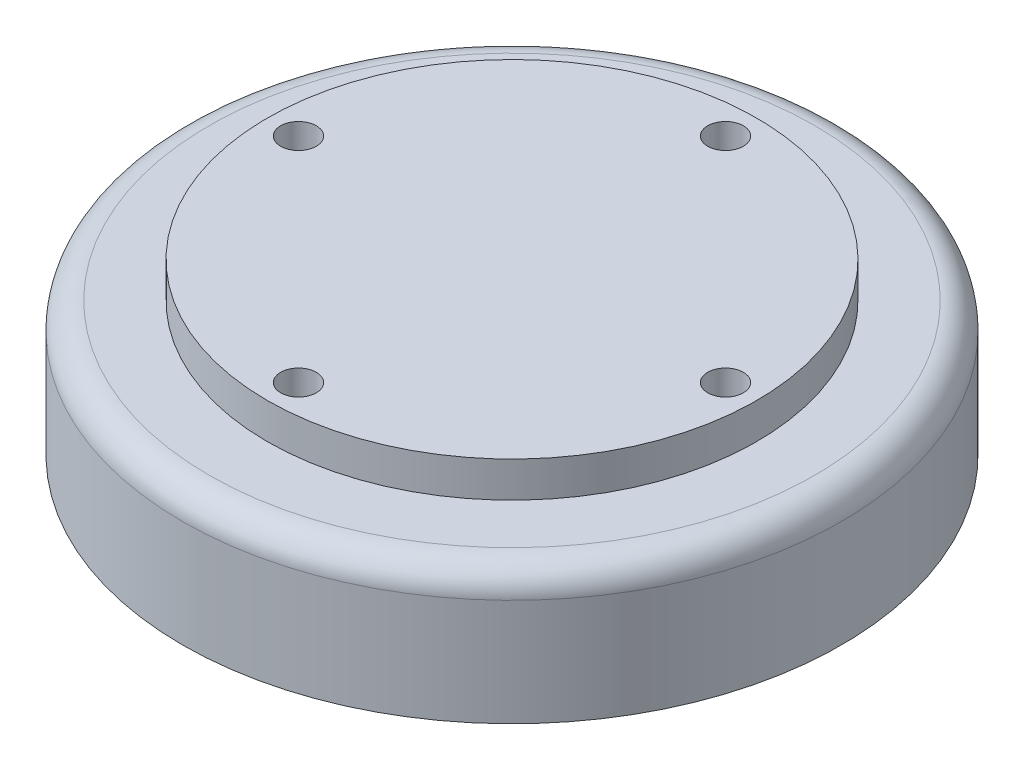
ISO-10303-21;
HEADER;
FILE_DESCRIPTION(('STEP AP214'),'2;1');
FILE_NAME('part.step','',(''),(''),'','','');
FILE_SCHEMA(('AUTOMOTIVE_DESIGN { 1 0 10303 214 1 1 1 1 }'));
ENDSEC;
DATA;
#1=APPLICATION_CONTEXT('core data for automotive mechanical design processes');
#2=APPLICATION_PROTOCOL_DEFINITION('international standard','automotive_design',2000,#1);
#3=PRODUCT_CONTEXT('',#1,'mechanical');
#4=PRODUCT('Part','Part','',(#3));
#5=PRODUCT_RELATED_PRODUCT_CATEGORY('part','',(#4));
#6=PRODUCT_DEFINITION_FORMATION('','',#4);
#7=PRODUCT_DEFINITION_CONTEXT('part definition',#1,'design');
#8=PRODUCT_DEFINITION('design','',#6,#7);
#9=PRODUCT_DEFINITION_SHAPE('','',#8);
#10=(LENGTH_UNIT() NAMED_UNIT(*) SI_UNIT(.MILLI.,.METRE.));
#11=(NAMED_UNIT(*) PLANE_ANGLE_UNIT() SI_UNIT($,.RADIAN.));
#12=(NAMED_UNIT(*) SI_UNIT($,.STERADIAN.) SOLID_ANGLE_UNIT());
#13=UNCERTAINTY_MEASURE_WITH_UNIT(LENGTH_MEASURE(1.E-05),#10,'distance_accuracy_value','');
#14=(GEOMETRIC_REPRESENTATION_CONTEXT(3) GLOBAL_UNCERTAINTY_ASSIGNED_CONTEXT((#13)) GLOBAL_UNIT_ASSIGNED_CONTEXT((#10,
#11,#12)) REPRESENTATION_CONTEXT('',''));
#15=CARTESIAN_POINT('',(0.,0.,0.));
#16=DIRECTION('',(0.,0.,1.));
#17=DIRECTION('',(1.,0.,0.));
#18=AXIS2_PLACEMENT_3D('',#15,#16,#17);
#19=CARTESIAN_POINT('',(0.,4.,0.));
#20=DIRECTION('',(0.,-1.,0.));
#21=DIRECTION('',(0.,0.,-1.));
#22=AXIS2_PLACEMENT_3D('',#19,#20,#21);
#23=CYLINDRICAL_SURFACE('',#22,27.469);
#24=CARTESIAN_POINT('',(0.,4.,0.));
#25=DIRECTION('',(0.,1.,0.));
#26=DIRECTION('',(0.,0.,1.));
#27=AXIS2_PLACEMENT_3D('',#24,#25,#26);
#28=CIRCLE('',#27,27.469);
#29=CARTESIAN_POINT('',(0.,4.,27.469));
#30=VERTEX_POINT('',#29);
#31=EDGE_CURVE('E149',#30,#30,#28,.T.);
#32=ORIENTED_EDGE('',*,*,#31,.F.);
#33=EDGE_LOOP('',(#32));
#34=FACE_BOUND('',#33,.T.);
#35=CARTESIAN_POINT('',(0.,0.,0.));
#36=DIRECTION('',(0.,1.,0.));
#37=DIRECTION('',(0.,0.,1.));
#38=AXIS2_PLACEMENT_3D('',#35,#36,#37);
#39=CIRCLE('',#38,27.469);
#40=CARTESIAN_POINT('',(0.,0.,27.469));
#41=VERTEX_POINT('',#40);
#42=EDGE_CURVE('E145',#41,#41,#39,.T.);
#43=ORIENTED_EDGE('',*,*,#42,.T.);
#44=EDGE_LOOP('',(#43));
#45=FACE_BOUND('',#44,.T.);
#46=ADVANCED_FACE('F33',(#34,#45),#23,.T.);
#47=CARTESIAN_POINT('',(0.,4.,0.));
#48=DIRECTION('',(0.,1.,0.));
#49=DIRECTION('',(0.,0.,1.));
#50=AXIS2_PLACEMENT_3D('',#47,#48,#49);
#51=PLANE('',#50);
#52=CARTESIAN_POINT('',(-23.971,4.,0.));
#53=DIRECTION('',(0.,1.,0.));
#54=DIRECTION('',(0.,0.,1.));
#55=AXIS2_PLACEMENT_3D('',#52,#53,#54);
#56=CIRCLE('',#55,2.);
#57=CARTESIAN_POINT('',(-23.971,4.,2.));
#58=VERTEX_POINT('',#57);
#59=EDGE_CURVE('E146',#58,#58,#56,.T.);
#60=ORIENTED_EDGE('',*,*,#59,.F.);
#61=EDGE_LOOP('',(#60));
#62=FACE_BOUND('',#61,.T.);
#63=CARTESIAN_POINT('',(0.,4.,-23.971));
#64=DIRECTION('',(0.,1.,0.));
#65=DIRECTION('',(0.,0.,1.));
#66=AXIS2_PLACEMENT_3D('',#63,#64,#65);
#67=CIRCLE('',#66,2.);
#68=CARTESIAN_POINT('',(0.,4.,-21.971));
#69=VERTEX_POINT('',#68);
#70=EDGE_CURVE('E150',#69,#69,#67,.T.);
#71=ORIENTED_EDGE('',*,*,#70,.F.);
#72=EDGE_LOOP('',(#71));
#73=FACE_BOUND('',#72,.T.);
#74=CARTESIAN_POINT('',(23.971,4.,0.));
#75=DIRECTION('',(0.,1.,0.));
#76=DIRECTION('',(0.,0.,1.));
#77=AXIS2_PLACEMENT_3D('',#74,#75,#76);
#78=CIRCLE('',#77,2.);
#79=CARTESIAN_POINT('',(23.971,4.,2.));
#80=VERTEX_POINT('',#79);
#81=EDGE_CURVE('E153',#80,#80,#78,.T.);
#82=ORIENTED_EDGE('',*,*,#81,.F.);
#83=EDGE_LOOP('',(#82));
#84=FACE_BOUND('',#83,.T.);
#85=CARTESIAN_POINT('',(0.,4.,23.971));
#86=DIRECTION('',(0.,1.,0.));
#87=DIRECTION('',(0.,0.,1.));
#88=AXIS2_PLACEMENT_3D('',#85,#86,#87);
#89=CIRCLE('',#88,2.);
#90=CARTESIAN_POINT('',(0.,4.,25.971));
#91=VERTEX_POINT('',#90);
#92=EDGE_CURVE('E156',#91,#91,#89,.T.);
#93=ORIENTED_EDGE('',*,*,#92,.F.);
#94=EDGE_LOOP('',(#93));
#95=FACE_BOUND('',#94,.T.);
#96=ORIENTED_EDGE('',*,*,#31,.T.);
#97=EDGE_LOOP('',(#96));
#98=FACE_BOUND('',#97,.T.);
#99=ADVANCED_FACE('F205',(#62,#73,#84,#95,#98),#51,.T.);
#100=CARTESIAN_POINT('',(0.,0.,23.971));
#101=DIRECTION('',(0.,1.,0.));
#102=DIRECTION('',(0.,0.,1.));
#103=AXIS2_PLACEMENT_3D('',#100,#101,#102);
#104=CYLINDRICAL_SURFACE('',#103,2.);
#105=ORIENTED_EDGE('',*,*,#92,.T.);
#106=EDGE_LOOP('',(#105));
#107=FACE_BOUND('',#106,.T.);
#108=CARTESIAN_POINT('',(0.,-7.,23.971));
#109=DIRECTION('',(0.,-1.,0.));
#110=DIRECTION('',(0.,0.,-1.));
#111=AXIS2_PLACEMENT_3D('',#108,#109,#110);
#112=CIRCLE('',#111,2.);
#113=CARTESIAN_POINT('',(0.,-7.,21.971));
#114=VERTEX_POINT('',#113);
#115=EDGE_CURVE('E168',#114,#114,#112,.T.);
#116=ORIENTED_EDGE('',*,*,#115,.T.);
#117=EDGE_LOOP('',(#116));
#118=FACE_BOUND('',#117,.T.);
#119=ADVANCED_FACE('F210',(#107,#118),#104,.F.);
#120=CARTESIAN_POINT('',(23.971,0.,0.));
#121=DIRECTION('',(0.,1.,0.));
#122=DIRECTION('',(0.,0.,1.));
#123=AXIS2_PLACEMENT_3D('',#120,#121,#122);
#124=CYLINDRICAL_SURFACE('',#123,2.);
#125=ORIENTED_EDGE('',*,*,#81,.T.);
#126=EDGE_LOOP('',(#125));
#127=FACE_BOUND('',#126,.T.);
#128=CARTESIAN_POINT('',(23.971,-7.,0.));
#129=DIRECTION('',(0.,-1.,0.));
#130=DIRECTION('',(0.,0.,-1.));
#131=AXIS2_PLACEMENT_3D('',#128,#129,#130);
#132=CIRCLE('',#131,2.);
#133=CARTESIAN_POINT('',(23.971,-7.,-2.00000000000001));
#134=VERTEX_POINT('',#133);
#135=EDGE_CURVE('E170',#134,#134,#132,.T.);
#136=ORIENTED_EDGE('',*,*,#135,.T.);
#137=EDGE_LOOP('',(#136));
#138=FACE_BOUND('',#137,.T.);
#139=ADVANCED_FACE('F200',(#127,#138),#124,.F.);
#140=CARTESIAN_POINT('',(0.,0.,-23.971));
#141=DIRECTION('',(0.,1.,0.));
#142=DIRECTION('',(0.,0.,1.));
#143=AXIS2_PLACEMENT_3D('',#140,#141,#142);
#144=CYLINDRICAL_SURFACE('',#143,2.);
#145=ORIENTED_EDGE('',*,*,#70,.T.);
#146=EDGE_LOOP('',(#145));
#147=FACE_BOUND('',#146,.T.);
#148=CARTESIAN_POINT('',(0.,-7.,-23.971));
#149=DIRECTION('',(0.,-1.,0.));
#150=DIRECTION('',(0.,0.,-1.));
#151=AXIS2_PLACEMENT_3D('',#148,#149,#150);
#152=CIRCLE('',#151,2.);
#153=CARTESIAN_POINT('',(0.,-7.,-25.971));
#154=VERTEX_POINT('',#153);
#155=EDGE_CURVE('E37',#154,#154,#152,.T.);
#156=ORIENTED_EDGE('',*,*,#155,.T.);
#157=EDGE_LOOP('',(#156));
#158=FACE_BOUND('',#157,.T.);
#159=ADVANCED_FACE('F177',(#147,#158),#144,.F.);
#160=CARTESIAN_POINT('',(-23.971,0.,0.));
#161=DIRECTION('',(0.,1.,0.));
#162=DIRECTION('',(0.,0.,1.));
#163=AXIS2_PLACEMENT_3D('',#160,#161,#162);
#164=CYLINDRICAL_SURFACE('',#163,2.);
#165=ORIENTED_EDGE('',*,*,#59,.T.);
#166=EDGE_LOOP('',(#165));
#167=FACE_BOUND('',#166,.T.);
#168=CARTESIAN_POINT('',(-23.971,-7.,0.));
#169=DIRECTION('',(0.,-1.,0.));
#170=DIRECTION('',(0.,0.,-1.));
#171=AXIS2_PLACEMENT_3D('',#168,#169,#170);
#172=CIRCLE('',#171,2.);
#173=CARTESIAN_POINT('',(-23.971,-7.,-2.));
#174=VERTEX_POINT('',#173);
#175=EDGE_CURVE('E165',#174,#174,#172,.T.);
#176=ORIENTED_EDGE('',*,*,#175,.T.);
#177=EDGE_LOOP('',(#176));
#178=FACE_BOUND('',#177,.T.);
#179=ADVANCED_FACE('F188',(#167,#178),#164,.F.);
#180=CARTESIAN_POINT('',(0.,0.,0.));
#181=DIRECTION('',(0.,-1.,0.));
#182=DIRECTION('',(0.,0.,-1.));
#183=AXIS2_PLACEMENT_3D('',#180,#181,#182);
#184=PLANE('',#183);
#185=CARTESIAN_POINT('',(0.,0.,0.));
#186=DIRECTION('',(0.,-1.,0.));
#187=DIRECTION('',(0.,0.,-1.));
#188=AXIS2_PLACEMENT_3D('',#185,#186,#187);
#189=CIRCLE('',#188,34.);
#190=CARTESIAN_POINT('',(0.,0.,-34.));
#191=VERTEX_POINT('',#190);
#192=EDGE_CURVE('E11',#191,#191,#189,.F.);
#193=ORIENTED_EDGE('',*,*,#192,.T.);
#194=EDGE_LOOP('',(#193));
#195=FACE_BOUND('',#194,.T.);
#196=ORIENTED_EDGE('',*,*,#42,.F.);
#197=EDGE_LOOP('',(#196));
#198=FACE_BOUND('',#197,.T.);
#199=ADVANCED_FACE('F190',(#195,#198),#184,.F.);
#200=CARTESIAN_POINT('',(0.,-15.,0.));
#201=DIRECTION('',(0.,-1.,0.));
#202=DIRECTION('',(0.,0.,-1.));
#203=AXIS2_PLACEMENT_3D('',#200,#201,#202);
#204=PLANE('',#203);
#205=DIRECTION('',(-0.81629577618712,0.,-0.577634145267632));
#206=VECTOR('',#205,1.);
#207=CARTESIAN_POINT('',(-2.97767565613404,-15.,32.1942041526142));
#208=LINE('',#207,#206);
#209=CARTESIAN_POINT('',(-2.97767565613404,-15.,32.1942041526142));
#210=VERTEX_POINT('',#209);
#211=CARTESIAN_POINT('',(-29.3698364788534,-15.,13.5183593138645));
#212=VERTEX_POINT('',#211);
#213=EDGE_CURVE('E50',#210,#212,#208,.T.);
#214=ORIENTED_EDGE('',*,*,#213,.F.);
#215=DIRECTION('',(-0.90839373198864,0.,0.418115806546166));
#216=VECTOR('',#215,1.);
#217=CARTESIAN_POINT('',(26.3921608227193,-15.,18.6758448387497));
#218=LINE('',#217,#216);
#219=CARTESIAN_POINT('',(26.3921608227193,-15.,18.6758448387497));
#220=VERTEX_POINT('',#219);
#221=EDGE_CURVE('E133',#220,#210,#218,.T.);
#222=ORIENTED_EDGE('',*,*,#221,.F.);
#223=DIRECTION('',(-0.09209795580152,0.,0.995749951813798));
#224=VECTOR('',#223,1.);
#225=CARTESIAN_POINT('',(29.3698364788533,-15.,-13.5183593138645));
#226=LINE('',#225,#224);
#227=CARTESIAN_POINT('',(29.3698364788533,-15.,-13.5183593138645));
#228=VERTEX_POINT('',#227);
#229=EDGE_CURVE('E131',#228,#220,#226,.T.);
#230=ORIENTED_EDGE('',*,*,#229,.F.);
#231=DIRECTION('',(0.81629577618712,0.,0.577634145267632));
#232=VECTOR('',#231,1.);
#233=CARTESIAN_POINT('',(2.97767565613402,-15.,-32.1942041526142));
#234=LINE('',#233,#232);
#235=CARTESIAN_POINT('',(2.97767565613402,-15.,-32.1942041526142));
#236=VERTEX_POINT('',#235);
#237=EDGE_CURVE('E98',#236,#228,#234,.T.);
#238=ORIENTED_EDGE('',*,*,#237,.F.);
#239=DIRECTION('',(0.90839373198864,0.,-0.418115806546166));
#240=VECTOR('',#239,1.);
#241=CARTESIAN_POINT('',(-26.3921608227193,-15.,-18.6758448387497));
#242=LINE('',#241,#240);
#243=CARTESIAN_POINT('',(-26.3921608227193,-15.,-18.6758448387497));
#244=VERTEX_POINT('',#243);
#245=EDGE_CURVE('E127',#244,#236,#242,.T.);
#246=ORIENTED_EDGE('',*,*,#245,.F.);
#247=DIRECTION('',(0.0920979558015204,0.,-0.995749951813798));
#248=VECTOR('',#247,1.);
#249=CARTESIAN_POINT('',(-29.3698364788534,-15.,13.5183593138645));
#250=LINE('',#249,#248);
#251=EDGE_CURVE('E124',#212,#244,#250,.T.);
#252=ORIENTED_EDGE('',*,*,#251,.F.);
#253=EDGE_LOOP('',(#214,#222,#230,#238,#246,#252));
#254=FACE_BOUND('',#253,.T.);
#255=CARTESIAN_POINT('',(0.,-15.,0.));
#256=DIRECTION('',(0.,-1.,0.));
#257=DIRECTION('',(0.,0.,-1.));
#258=AXIS2_PLACEMENT_3D('',#255,#256,#257);
#259=CIRCLE('',#258,37.);
#260=CARTESIAN_POINT('',(0.,-15.,-37.));
#261=VERTEX_POINT('',#260);
#262=EDGE_CURVE('E137',#261,#261,#259,.T.);
#263=ORIENTED_EDGE('',*,*,#262,.T.);
#264=EDGE_LOOP('',(#263));
#265=FACE_BOUND('',#264,.T.);
#266=ADVANCED_FACE('F197',(#254,#265),#204,.T.);
#267=CARTESIAN_POINT('',(0.,-15.,0.));
#268=DIRECTION('',(0.,1.,0.));
#269=DIRECTION('',(0.,0.,1.));
#270=AXIS2_PLACEMENT_3D('',#267,#268,#269);
#271=CYLINDRICAL_SURFACE('',#270,37.);
#272=CARTESIAN_POINT('',(0.,-3.,0.));
#273=DIRECTION('',(0.,-1.,0.));
#274=DIRECTION('',(0.,0.,-1.));
#275=AXIS2_PLACEMENT_3D('',#272,#273,#274);
#276=CIRCLE('',#275,37.);
#277=CARTESIAN_POINT('',(0.,-3.,-37.));
#278=VERTEX_POINT('',#277);
#279=EDGE_CURVE('E42',#278,#278,#276,.T.);
#280=ORIENTED_EDGE('',*,*,#279,.T.);
#281=EDGE_LOOP('',(#280));
#282=FACE_BOUND('',#281,.T.);
#283=ORIENTED_EDGE('',*,*,#262,.F.);
#284=EDGE_LOOP('',(#283));
#285=FACE_BOUND('',#284,.T.);
#286=ADVANCED_FACE('F266',(#282,#285),#271,.T.);
#287=CARTESIAN_POINT('',(-2.97767565613404,-7.,32.1942041526142));
#288=DIRECTION('',(-0.577634145267632,0.,0.81629577618712));
#289=DIRECTION('',(0.81629577618712,0.,0.577634145267632));
#290=AXIS2_PLACEMENT_3D('',#287,#288,#289);
#291=PLANE('',#290);
#292=ORIENTED_EDGE('',*,*,#213,.T.);
#293=DIRECTION('',(0.,-1.,0.));
#294=VECTOR('',#293,1.);
#295=CARTESIAN_POINT('',(-29.3698364788534,-7.,13.5183593138645));
#296=LINE('',#295,#294);
#297=CARTESIAN_POINT('',(-29.3698364788534,-7.,13.5183593138645));
#298=VERTEX_POINT('',#297);
#299=EDGE_CURVE('E80',#298,#212,#296,.T.);
#300=ORIENTED_EDGE('',*,*,#299,.F.);
#301=DIRECTION('',(-0.81629577618712,0.,-0.577634145267632));
#302=VECTOR('',#301,1.);
#303=CARTESIAN_POINT('',(-2.97767565613404,-7.,32.1942041526142));
#304=LINE('',#303,#302);
#305=CARTESIAN_POINT('',(-2.97767565613404,-7.,32.1942041526142));
#306=VERTEX_POINT('',#305);
#307=EDGE_CURVE('E135',#306,#298,#304,.T.);
#308=ORIENTED_EDGE('',*,*,#307,.F.);
#309=DIRECTION('',(0.,-1.,0.));
#310=VECTOR('',#309,1.);
#311=CARTESIAN_POINT('',(-2.97767565613404,-7.,32.1942041526142));
#312=LINE('',#311,#310);
#313=EDGE_CURVE('E58',#306,#210,#312,.T.);
#314=ORIENTED_EDGE('',*,*,#313,.T.);
#315=EDGE_LOOP('',(#292,#300,#308,#314));
#316=FACE_BOUND('',#315,.T.);
#317=ADVANCED_FACE('F304',(#316),#291,.F.);
#318=CARTESIAN_POINT('',(26.3921608227193,-7.,18.6758448387497));
#319=DIRECTION('',(0.418115806546166,0.,0.90839373198864));
#320=DIRECTION('',(0.90839373198864,0.,-0.418115806546166));
#321=AXIS2_PLACEMENT_3D('',#318,#319,#320);
#322=PLANE('',#321);
#323=ORIENTED_EDGE('',*,*,#221,.T.);
#324=ORIENTED_EDGE('',*,*,#313,.F.);
#325=DIRECTION('',(-0.90839373198864,0.,0.418115806546166));
#326=VECTOR('',#325,1.);
#327=CARTESIAN_POINT('',(26.3921608227193,-7.,18.6758448387497));
#328=LINE('',#327,#326);
#329=CARTESIAN_POINT('',(26.3921608227193,-7.,18.6758448387497));
#330=VERTEX_POINT('',#329);
#331=EDGE_CURVE('E110',#330,#306,#328,.T.);
#332=ORIENTED_EDGE('',*,*,#331,.F.);
#333=DIRECTION('',(0.,-1.,0.));
#334=VECTOR('',#333,1.);
#335=CARTESIAN_POINT('',(26.3921608227193,-7.,18.6758448387497));
#336=LINE('',#335,#334);
#337=EDGE_CURVE('E102',#330,#220,#336,.T.);
#338=ORIENTED_EDGE('',*,*,#337,.T.);
#339=EDGE_LOOP('',(#323,#324,#332,#338));
#340=FACE_BOUND('',#339,.T.);
#341=ADVANCED_FACE('F310',(#340),#322,.F.);
#342=CARTESIAN_POINT('',(29.3698364788533,-7.,-13.5183593138645));
#343=DIRECTION('',(0.995749951813798,0.,0.09209795580152));
#344=DIRECTION('',(0.09209795580152,0.,-0.995749951813798));
#345=AXIS2_PLACEMENT_3D('',#342,#343,#344);
#346=PLANE('',#345);
#347=ORIENTED_EDGE('',*,*,#229,.T.);
#348=ORIENTED_EDGE('',*,*,#337,.F.);
#349=DIRECTION('',(-0.09209795580152,0.,0.995749951813798));
#350=VECTOR('',#349,1.);
#351=CARTESIAN_POINT('',(29.3698364788533,-7.,-13.5183593138645));
#352=LINE('',#351,#350);
#353=CARTESIAN_POINT('',(29.3698364788533,-7.,-13.5183593138645));
#354=VERTEX_POINT('',#353);
#355=EDGE_CURVE('E106',#354,#330,#352,.T.);
#356=ORIENTED_EDGE('',*,*,#355,.F.);
#357=DIRECTION('',(0.,-1.,0.));
#358=VECTOR('',#357,1.);
#359=CARTESIAN_POINT('',(29.3698364788533,-7.,-13.5183593138645));
#360=LINE('',#359,#358);
#361=EDGE_CURVE('E91',#354,#228,#360,.T.);
#362=ORIENTED_EDGE('',*,*,#361,.T.);
#363=EDGE_LOOP('',(#347,#348,#356,#362));
#364=FACE_BOUND('',#363,.T.);
#365=ADVANCED_FACE('F107',(#364),#346,.F.);
#366=CARTESIAN_POINT('',(2.97767565613402,-7.,-32.1942041526142));
#367=DIRECTION('',(0.577634145267632,0.,-0.81629577618712));
#368=DIRECTION('',(-0.81629577618712,0.,-0.577634145267632));
#369=AXIS2_PLACEMENT_3D('',#366,#367,#368);
#370=PLANE('',#369);
#371=ORIENTED_EDGE('',*,*,#237,.T.);
#372=ORIENTED_EDGE('',*,*,#361,.F.);
#373=DIRECTION('',(0.81629577618712,0.,0.577634145267632));
#374=VECTOR('',#373,1.);
#375=CARTESIAN_POINT('',(2.97767565613402,-7.,-32.1942041526142));
#376=LINE('',#375,#374);
#377=CARTESIAN_POINT('',(2.97767565613402,-7.,-32.1942041526142));
#378=VERTEX_POINT('',#377);
#379=EDGE_CURVE('E95',#378,#354,#376,.T.);
#380=ORIENTED_EDGE('',*,*,#379,.F.);
#381=DIRECTION('',(0.,-1.,0.));
#382=VECTOR('',#381,1.);
#383=CARTESIAN_POINT('',(2.97767565613402,-7.,-32.1942041526142));
#384=LINE('',#383,#382);
#385=EDGE_CURVE('E103',#378,#236,#384,.T.);
#386=ORIENTED_EDGE('',*,*,#385,.T.);
#387=EDGE_LOOP('',(#371,#372,#380,#386));
#388=FACE_BOUND('',#387,.T.);
#389=ADVANCED_FACE('F93',(#388),#370,.F.);
#390=CARTESIAN_POINT('',(-26.3921608227193,-7.,-18.6758448387497));
#391=DIRECTION('',(-0.418115806546166,0.,-0.90839373198864));
#392=DIRECTION('',(-0.90839373198864,0.,0.418115806546166));
#393=AXIS2_PLACEMENT_3D('',#390,#391,#392);
#394=PLANE('',#393);
#395=ORIENTED_EDGE('',*,*,#245,.T.);
#396=ORIENTED_EDGE('',*,*,#385,.F.);
#397=DIRECTION('',(0.90839373198864,0.,-0.418115806546166));
#398=VECTOR('',#397,1.);
#399=CARTESIAN_POINT('',(-26.3921608227193,-7.,-18.6758448387497));
#400=LINE('',#399,#398);
#401=CARTESIAN_POINT('',(-26.3921608227193,-7.,-18.6758448387497));
#402=VERTEX_POINT('',#401);
#403=EDGE_CURVE('E116',#402,#378,#400,.T.);
#404=ORIENTED_EDGE('',*,*,#403,.F.);
#405=DIRECTION('',(0.,-1.,0.));
#406=VECTOR('',#405,1.);
#407=CARTESIAN_POINT('',(-26.3921608227193,-7.,-18.6758448387497));
#408=LINE('',#407,#406);
#409=EDGE_CURVE('E140',#402,#244,#408,.T.);
#410=ORIENTED_EDGE('',*,*,#409,.T.);
#411=EDGE_LOOP('',(#395,#396,#404,#410));
#412=FACE_BOUND('',#411,.T.);
#413=ADVANCED_FACE('F332',(#412),#394,.F.);
#414=CARTESIAN_POINT('',(-29.3698364788534,-7.,13.5183593138645));
#415=DIRECTION('',(-0.995749951813798,0.,-0.0920979558015204));
#416=DIRECTION('',(-0.0920979558015204,0.,0.995749951813798));
#417=AXIS2_PLACEMENT_3D('',#414,#415,#416);
#418=PLANE('',#417);
#419=ORIENTED_EDGE('',*,*,#251,.T.);
#420=ORIENTED_EDGE('',*,*,#409,.F.);
#421=DIRECTION('',(0.0920979558015204,0.,-0.995749951813798));
#422=VECTOR('',#421,1.);
#423=CARTESIAN_POINT('',(-29.3698364788534,-7.,13.5183593138645));
#424=LINE('',#423,#422);
#425=EDGE_CURVE('E118',#298,#402,#424,.T.);
#426=ORIENTED_EDGE('',*,*,#425,.F.);
#427=ORIENTED_EDGE('',*,*,#299,.T.);
#428=EDGE_LOOP('',(#419,#420,#426,#427));
#429=FACE_BOUND('',#428,.T.);
#430=ADVANCED_FACE('F181',(#429),#418,.F.);
#431=CARTESIAN_POINT('',(0.,-7.,0.));
#432=DIRECTION('',(0.,-1.,0.));
#433=DIRECTION('',(0.,0.,-1.));
#434=AXIS2_PLACEMENT_3D('',#431,#432,#433);
#435=PLANE('',#434);
#436=ORIENTED_EDGE('',*,*,#155,.F.);
#437=EDGE_LOOP('',(#436));
#438=FACE_BOUND('',#437,.T.);
#439=ORIENTED_EDGE('',*,*,#135,.F.);
#440=EDGE_LOOP('',(#439));
#441=FACE_BOUND('',#440,.T.);
#442=ORIENTED_EDGE('',*,*,#115,.F.);
#443=EDGE_LOOP('',(#442));
#444=FACE_BOUND('',#443,.T.);
#445=ORIENTED_EDGE('',*,*,#175,.F.);
#446=EDGE_LOOP('',(#445));
#447=FACE_BOUND('',#446,.T.);
#448=ORIENTED_EDGE('',*,*,#307,.T.);
#449=ORIENTED_EDGE('',*,*,#425,.T.);
#450=ORIENTED_EDGE('',*,*,#403,.T.);
#451=ORIENTED_EDGE('',*,*,#379,.T.);
#452=ORIENTED_EDGE('',*,*,#355,.T.);
#453=ORIENTED_EDGE('',*,*,#331,.T.);
#454=EDGE_LOOP('',(#448,#449,#450,#451,#452,#453));
#455=FACE_BOUND('',#454,.T.);
#456=ADVANCED_FACE('F113',(#438,#441,#444,#447,#455),#435,.T.);
#457=CARTESIAN_POINT('',(0.,-3.,0.));
#458=DIRECTION('',(0.,-1.,0.));
#459=DIRECTION('',(0.,0.,-1.));
#460=AXIS2_PLACEMENT_3D('',#457,#458,#459);
#461=TOROIDAL_SURFACE('',#460,34.,3.);
#462=ORIENTED_EDGE('',*,*,#192,.F.);
#463=EDGE_LOOP('',(#462));
#464=FACE_BOUND('',#463,.T.);
#465=ORIENTED_EDGE('',*,*,#279,.F.);
#466=EDGE_LOOP('',(#465));
#467=FACE_BOUND('',#466,.T.);
#468=ADVANCED_FACE('F35',(#464,#467),#461,.T.);
#469=CLOSED_SHELL('',(#46,#99,#119,#139,#159,#179,#199,#266,#286,#317,#341,#365,#389,#413,#430,
#456,#468));
#470=MANIFOLD_SOLID_BREP('B2',#469);
#471=ADVANCED_BREP_SHAPE_REPRESENTATION('',(#18,#470),#14);
#472=SHAPE_DEFINITION_REPRESENTATION(#9,#471);
ENDSEC;
END-ISO-10303-21;
